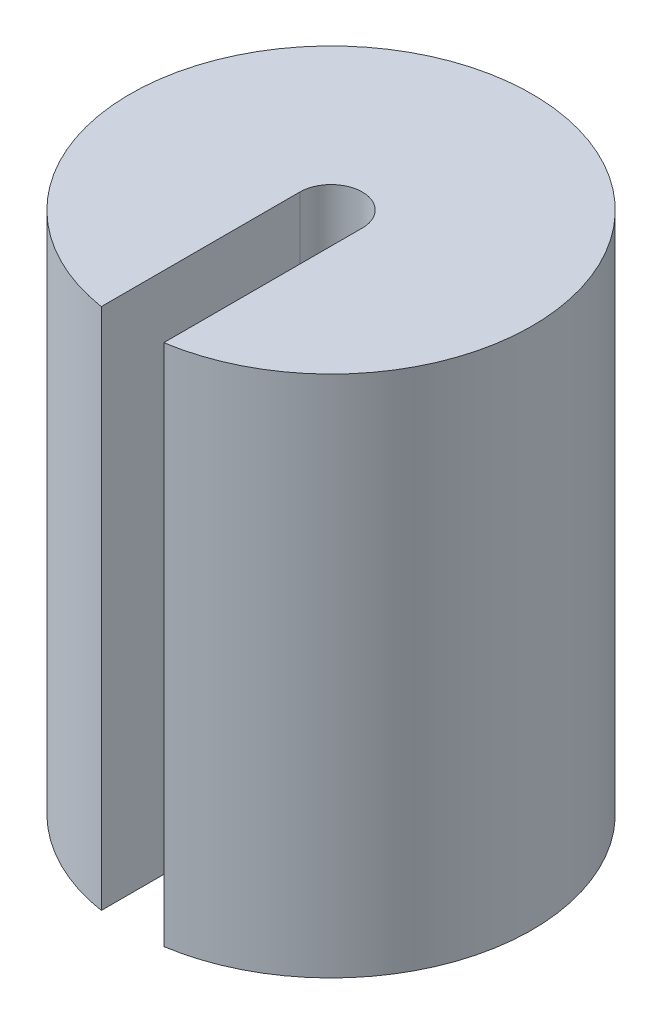
ISO-10303-21;
HEADER;
FILE_DESCRIPTION(('STEP AP214'),'2;1');
FILE_NAME('part.step','',(''),(''),'','','');
FILE_SCHEMA(('AUTOMOTIVE_DESIGN { 1 0 10303 214 1 1 1 1 }'));
ENDSEC;
DATA;
#1=APPLICATION_CONTEXT('core data for automotive mechanical design processes');
#2=APPLICATION_PROTOCOL_DEFINITION('international standard','automotive_design',2000,#1);
#3=PRODUCT_CONTEXT('',#1,'mechanical');
#4=PRODUCT('Part','Part','',(#3));
#5=PRODUCT_RELATED_PRODUCT_CATEGORY('part','',(#4));
#6=PRODUCT_DEFINITION_FORMATION('','',#4);
#7=PRODUCT_DEFINITION_CONTEXT('part definition',#1,'design');
#8=PRODUCT_DEFINITION('design','',#6,#7);
#9=PRODUCT_DEFINITION_SHAPE('','',#8);
#10=(LENGTH_UNIT() NAMED_UNIT(*) SI_UNIT(.MILLI.,.METRE.));
#11=(NAMED_UNIT(*) PLANE_ANGLE_UNIT() SI_UNIT($,.RADIAN.));
#12=(NAMED_UNIT(*) SI_UNIT($,.STERADIAN.) SOLID_ANGLE_UNIT());
#13=UNCERTAINTY_MEASURE_WITH_UNIT(LENGTH_MEASURE(1.E-05),#10,'distance_accuracy_value','');
#14=(GEOMETRIC_REPRESENTATION_CONTEXT(3) GLOBAL_UNCERTAINTY_ASSIGNED_CONTEXT((#13)) GLOBAL_UNIT_ASSIGNED_CONTEXT((#10,
#11,#12)) REPRESENTATION_CONTEXT('',''));
#15=CARTESIAN_POINT('',(0.,0.,0.));
#16=DIRECTION('',(0.,0.,1.));
#17=DIRECTION('',(1.,0.,0.));
#18=AXIS2_PLACEMENT_3D('',#15,#16,#17);
#19=CARTESIAN_POINT('',(0.,54.,0.));
#20=DIRECTION('',(0.,-1.,0.));
#21=DIRECTION('',(0.,0.,-1.));
#22=AXIS2_PLACEMENT_3D('',#19,#20,#21);
#23=CYLINDRICAL_SURFACE('',#22,20.75);
#24=CARTESIAN_POINT('',(0.,54.,0.));
#25=DIRECTION('',(0.,1.,0.));
#26=DIRECTION('',(0.,0.,1.));
#27=AXIS2_PLACEMENT_3D('',#24,#25,#26);
#28=CIRCLE('',#27,20.75);
#29=CARTESIAN_POINT('',(3.225,54.,20.4978504970643));
#30=VERTEX_POINT('',#29);
#31=CARTESIAN_POINT('',(-3.225,54.,20.4978504970643));
#32=VERTEX_POINT('',#31);
#33=EDGE_CURVE('E100',#30,#32,#28,.T.);
#34=ORIENTED_EDGE('',*,*,#33,.F.);
#35=DIRECTION('',(0.,-1.,0.));
#36=VECTOR('',#35,1.);
#37=CARTESIAN_POINT('',(3.225,54.,20.4978504970643));
#38=LINE('',#37,#36);
#39=CARTESIAN_POINT('',(3.225,0.,20.4978504970643));
#40=VERTEX_POINT('',#39);
#41=EDGE_CURVE('E106',#30,#40,#38,.T.);
#42=ORIENTED_EDGE('',*,*,#41,.T.);
#43=CARTESIAN_POINT('',(0.,0.,0.));
#44=DIRECTION('',(0.,1.,0.));
#45=DIRECTION('',(0.,0.,1.));
#46=AXIS2_PLACEMENT_3D('',#43,#44,#45);
#47=CIRCLE('',#46,20.75);
#48=CARTESIAN_POINT('',(-3.225,0.,20.4978504970643));
#49=VERTEX_POINT('',#48);
#50=EDGE_CURVE('E108',#40,#49,#47,.T.);
#51=ORIENTED_EDGE('',*,*,#50,.T.);
#52=DIRECTION('',(0.,-1.,0.));
#53=VECTOR('',#52,1.);
#54=CARTESIAN_POINT('',(-3.225,54.,20.4978504970643));
#55=LINE('',#54,#53);
#56=EDGE_CURVE('E56',#49,#32,#55,.F.);
#57=ORIENTED_EDGE('',*,*,#56,.T.);
#58=EDGE_LOOP('',(#34,#42,#51,#57));
#59=FACE_BOUND('',#58,.T.);
#60=ADVANCED_FACE('F42',(#59),#23,.T.);
#61=CARTESIAN_POINT('',(0.,54.,0.));
#62=DIRECTION('',(0.,1.,0.));
#63=DIRECTION('',(0.,0.,1.));
#64=AXIS2_PLACEMENT_3D('',#61,#62,#63);
#65=PLANE('',#64);
#66=DIRECTION('',(0.,0.,-1.));
#67=VECTOR('',#66,1.);
#68=CARTESIAN_POINT('',(3.225,54.,0.));
#69=LINE('',#68,#67);
#70=CARTESIAN_POINT('',(3.225,54.,0.));
#71=VERTEX_POINT('',#70);
#72=EDGE_CURVE('E88',#30,#71,#69,.T.);
#73=ORIENTED_EDGE('',*,*,#72,.F.);
#74=ORIENTED_EDGE('',*,*,#33,.T.);
#75=DIRECTION('',(0.,0.,1.));
#76=VECTOR('',#75,1.);
#77=CARTESIAN_POINT('',(-3.225,54.,0.));
#78=LINE('',#77,#76);
#79=CARTESIAN_POINT('',(-3.225,54.,0.));
#80=VERTEX_POINT('',#79);
#81=EDGE_CURVE('E83',#80,#32,#78,.T.);
#82=ORIENTED_EDGE('',*,*,#81,.F.);
#83=CARTESIAN_POINT('',(0.,54.,0.));
#84=DIRECTION('',(0.,1.,0.));
#85=DIRECTION('',(0.,0.,1.));
#86=AXIS2_PLACEMENT_3D('',#83,#84,#85);
#87=CIRCLE('',#86,3.225);
#88=EDGE_CURVE('E91',#71,#80,#87,.T.);
#89=ORIENTED_EDGE('',*,*,#88,.F.);
#90=EDGE_LOOP('',(#73,#74,#82,#89));
#91=FACE_BOUND('',#90,.T.);
#92=ADVANCED_FACE('F98',(#91),#65,.T.);
#93=CARTESIAN_POINT('',(0.,0.,0.));
#94=DIRECTION('',(0.,1.,0.));
#95=DIRECTION('',(0.,0.,1.));
#96=AXIS2_PLACEMENT_3D('',#93,#94,#95);
#97=PLANE('',#96);
#98=ORIENTED_EDGE('',*,*,#50,.F.);
#99=DIRECTION('',(0.,0.,-1.));
#100=VECTOR('',#99,1.);
#101=CARTESIAN_POINT('',(3.225,0.,0.));
#102=LINE('',#101,#100);
#103=CARTESIAN_POINT('',(3.225,0.,0.));
#104=VERTEX_POINT('',#103);
#105=EDGE_CURVE('E11',#40,#104,#102,.T.);
#106=ORIENTED_EDGE('',*,*,#105,.T.);
#107=CARTESIAN_POINT('',(0.,0.,0.));
#108=DIRECTION('',(0.,1.,0.));
#109=DIRECTION('',(0.,0.,1.));
#110=AXIS2_PLACEMENT_3D('',#107,#108,#109);
#111=CIRCLE('',#110,3.225);
#112=CARTESIAN_POINT('',(-3.225,0.,0.));
#113=VERTEX_POINT('',#112);
#114=EDGE_CURVE('E49',#104,#113,#111,.T.);
#115=ORIENTED_EDGE('',*,*,#114,.T.);
#116=DIRECTION('',(0.,0.,1.));
#117=VECTOR('',#116,1.);
#118=CARTESIAN_POINT('',(-3.225,0.,0.));
#119=LINE('',#118,#117);
#120=EDGE_CURVE('E84',#113,#49,#119,.T.);
#121=ORIENTED_EDGE('',*,*,#120,.T.);
#122=EDGE_LOOP('',(#98,#106,#115,#121));
#123=FACE_BOUND('',#122,.T.);
#124=ADVANCED_FACE('F114',(#123),#97,.F.);
#125=CARTESIAN_POINT('',(0.,-6.6,0.));
#126=DIRECTION('',(0.,1.,0.));
#127=DIRECTION('',(0.,0.,1.));
#128=AXIS2_PLACEMENT_3D('',#125,#126,#127);
#129=CYLINDRICAL_SURFACE('',#128,3.225);
#130=DIRECTION('',(0.,1.,0.));
#131=VECTOR('',#130,1.);
#132=CARTESIAN_POINT('',(3.225,-6.6,0.));
#133=LINE('',#132,#131);
#134=EDGE_CURVE('E87',#104,#71,#133,.T.);
#135=ORIENTED_EDGE('',*,*,#134,.T.);
#136=ORIENTED_EDGE('',*,*,#88,.T.);
#137=DIRECTION('',(0.,1.,0.));
#138=VECTOR('',#137,1.);
#139=CARTESIAN_POINT('',(-3.225,-6.6,0.));
#140=LINE('',#139,#138);
#141=EDGE_CURVE('E79',#113,#80,#140,.T.);
#142=ORIENTED_EDGE('',*,*,#141,.F.);
#143=ORIENTED_EDGE('',*,*,#114,.F.);
#144=EDGE_LOOP('',(#135,#136,#142,#143));
#145=FACE_BOUND('',#144,.T.);
#146=ADVANCED_FACE('F92',(#145),#129,.F.);
#147=CARTESIAN_POINT('',(3.225,-6.6,0.));
#148=DIRECTION('',(1.,0.,0.));
#149=DIRECTION('',(0.,0.,-1.));
#150=AXIS2_PLACEMENT_3D('',#147,#148,#149);
#151=PLANE('',#150);
#152=ORIENTED_EDGE('',*,*,#72,.T.);
#153=ORIENTED_EDGE('',*,*,#134,.F.);
#154=ORIENTED_EDGE('',*,*,#105,.F.);
#155=ORIENTED_EDGE('',*,*,#41,.F.);
#156=EDGE_LOOP('',(#152,#153,#154,#155));
#157=FACE_BOUND('',#156,.T.);
#158=ADVANCED_FACE('F115',(#157),#151,.F.);
#159=CARTESIAN_POINT('',(-3.225,-6.6,0.));
#160=DIRECTION('',(-1.,0.,0.));
#161=DIRECTION('',(0.,0.,1.));
#162=AXIS2_PLACEMENT_3D('',#159,#160,#161);
#163=PLANE('',#162);
#164=ORIENTED_EDGE('',*,*,#120,.F.);
#165=ORIENTED_EDGE('',*,*,#141,.T.);
#166=ORIENTED_EDGE('',*,*,#81,.T.);
#167=ORIENTED_EDGE('',*,*,#56,.F.);
#168=EDGE_LOOP('',(#164,#165,#166,#167));
#169=FACE_BOUND('',#168,.T.);
#170=ADVANCED_FACE('F81',(#169),#163,.F.);
#171=CLOSED_SHELL('',(#60,#92,#124,#146,#158,#170));
#172=MANIFOLD_SOLID_BREP('B2',#171);
#173=ADVANCED_BREP_SHAPE_REPRESENTATION('',(#18,#172),#14);
#174=SHAPE_DEFINITION_REPRESENTATION(#9,#173);
ENDSEC;
END-ISO-10303-21;
